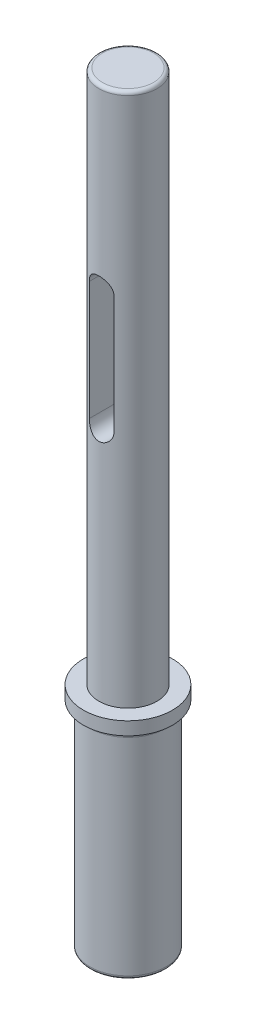
ISO-10303-21;
HEADER;
FILE_DESCRIPTION(('STEP AP214'),'2;1');
FILE_NAME('part.step','',(''),(''),'','','');
FILE_SCHEMA(('AUTOMOTIVE_DESIGN { 1 0 10303 214 1 1 1 1 }'));
ENDSEC;
DATA;
#1=APPLICATION_CONTEXT('core data for automotive mechanical design processes');
#2=APPLICATION_PROTOCOL_DEFINITION('international standard','automotive_design',2000,#1);
#3=PRODUCT_CONTEXT('',#1,'mechanical');
#4=PRODUCT('Part','Part','',(#3));
#5=PRODUCT_RELATED_PRODUCT_CATEGORY('part','',(#4));
#6=PRODUCT_DEFINITION_FORMATION('','',#4);
#7=PRODUCT_DEFINITION_CONTEXT('part definition',#1,'design');
#8=PRODUCT_DEFINITION('design','',#6,#7);
#9=PRODUCT_DEFINITION_SHAPE('','',#8);
#10=(LENGTH_UNIT() NAMED_UNIT(*) SI_UNIT(.MILLI.,.METRE.));
#11=(NAMED_UNIT(*) PLANE_ANGLE_UNIT() SI_UNIT($,.RADIAN.));
#12=(NAMED_UNIT(*) SI_UNIT($,.STERADIAN.) SOLID_ANGLE_UNIT());
#13=UNCERTAINTY_MEASURE_WITH_UNIT(LENGTH_MEASURE(1.E-05),#10,'distance_accuracy_value','');
#14=(GEOMETRIC_REPRESENTATION_CONTEXT(3) GLOBAL_UNCERTAINTY_ASSIGNED_CONTEXT((#13)) GLOBAL_UNIT_ASSIGNED_CONTEXT((#10,
#11,#12)) REPRESENTATION_CONTEXT('',''));
#15=CARTESIAN_POINT('',(0.,0.,0.));
#16=DIRECTION('',(0.,0.,1.));
#17=DIRECTION('',(1.,0.,0.));
#18=AXIS2_PLACEMENT_3D('',#15,#16,#17);
#19=CARTESIAN_POINT('',(0.,163.322,0.));
#20=DIRECTION('',(0.,-1.,0.));
#21=DIRECTION('',(0.,0.,-1.));
#22=AXIS2_PLACEMENT_3D('',#19,#20,#21);
#23=CYLINDRICAL_SURFACE('',#22,9.525);
#24=CARTESIAN_POINT('',(0.,46.228,0.));
#25=DIRECTION('',(0.,1.,0.));
#26=DIRECTION('',(0.,0.,1.));
#27=AXIS2_PLACEMENT_3D('',#24,#25,#26);
#28=CIRCLE('',#27,9.525);
#29=CARTESIAN_POINT('',(0.,46.228,9.525));
#30=VERTEX_POINT('',#29);
#31=EDGE_CURVE('E182',#30,#30,#28,.T.);
#32=ORIENTED_EDGE('',*,*,#31,.T.);
#33=EDGE_LOOP('',(#32));
#34=FACE_BOUND('',#33,.T.);
#35=CARTESIAN_POINT('',(0.,49.022,0.));
#36=DIRECTION('',(0.,1.,0.));
#37=DIRECTION('',(0.,0.,1.));
#38=AXIS2_PLACEMENT_3D('',#35,#36,#37);
#39=CIRCLE('',#38,9.525);
#40=CARTESIAN_POINT('',(0.,49.022,9.525));
#41=VERTEX_POINT('',#40);
#42=EDGE_CURVE('E184',#41,#41,#39,.T.);
#43=ORIENTED_EDGE('',*,*,#42,.F.);
#44=EDGE_LOOP('',(#43));
#45=FACE_BOUND('',#44,.T.);
#46=ADVANCED_FACE('F34',(#34,#45),#23,.T.);
#47=CARTESIAN_POINT('',(0.,46.228,0.));
#48=DIRECTION('',(0.,1.,0.));
#49=DIRECTION('',(0.,0.,1.));
#50=AXIS2_PLACEMENT_3D('',#47,#48,#49);
#51=PLANE('',#50);
#52=CARTESIAN_POINT('',(0.,46.228,0.));
#53=DIRECTION('',(0.,1.,0.));
#54=DIRECTION('',(0.,0.,1.));
#55=AXIS2_PLACEMENT_3D('',#52,#53,#54);
#56=CIRCLE('',#55,9.398);
#57=CARTESIAN_POINT('',(0.,46.228,9.398));
#58=VERTEX_POINT('',#57);
#59=EDGE_CURVE('E181',#58,#58,#56,.T.);
#60=ORIENTED_EDGE('',*,*,#59,.T.);
#61=EDGE_LOOP('',(#60));
#62=FACE_BOUND('',#61,.T.);
#63=ORIENTED_EDGE('',*,*,#31,.F.);
#64=EDGE_LOOP('',(#63));
#65=FACE_BOUND('',#64,.T.);
#66=ADVANCED_FACE('F154',(#62,#65),#51,.F.);
#67=CARTESIAN_POINT('',(0.,46.228,0.));
#68=DIRECTION('',(0.,-1.,0.));
#69=DIRECTION('',(0.,0.,-1.));
#70=AXIS2_PLACEMENT_3D('',#67,#68,#69);
#71=CYLINDRICAL_SURFACE('',#70,8.128);
#72=CARTESIAN_POINT('',(0.,0.761999999999999,0.));
#73=DIRECTION('',(0.,1.,0.));
#74=DIRECTION('',(0.,0.,1.));
#75=AXIS2_PLACEMENT_3D('',#72,#73,#74);
#76=CIRCLE('',#75,8.128);
#77=CARTESIAN_POINT('',(0.,0.761999999999999,8.128));
#78=VERTEX_POINT('',#77);
#79=EDGE_CURVE('E42',#78,#78,#76,.T.);
#80=ORIENTED_EDGE('',*,*,#79,.T.);
#81=EDGE_LOOP('',(#80));
#82=FACE_BOUND('',#81,.T.);
#83=CARTESIAN_POINT('',(0.,44.958,0.));
#84=DIRECTION('',(0.,1.,0.));
#85=DIRECTION('',(0.,0.,1.));
#86=AXIS2_PLACEMENT_3D('',#83,#84,#85);
#87=CIRCLE('',#86,8.128);
#88=CARTESIAN_POINT('',(0.,44.958,8.128));
#89=VERTEX_POINT('',#88);
#90=EDGE_CURVE('E178',#89,#89,#87,.F.);
#91=ORIENTED_EDGE('',*,*,#90,.T.);
#92=EDGE_LOOP('',(#91));
#93=FACE_BOUND('',#92,.T.);
#94=ADVANCED_FACE('F142',(#82,#93),#71,.T.);
#95=CARTESIAN_POINT('',(0.,0.,0.));
#96=DIRECTION('',(0.,1.,0.));
#97=DIRECTION('',(0.,0.,1.));
#98=AXIS2_PLACEMENT_3D('',#95,#96,#97);
#99=PLANE('',#98);
#100=CARTESIAN_POINT('',(0.,0.,0.));
#101=DIRECTION('',(0.,1.,0.));
#102=DIRECTION('',(0.,0.,1.));
#103=AXIS2_PLACEMENT_3D('',#100,#101,#102);
#104=CIRCLE('',#103,7.366);
#105=CARTESIAN_POINT('',(0.,0.,7.366));
#106=VERTEX_POINT('',#105);
#107=EDGE_CURVE('E12',#106,#106,#104,.F.);
#108=ORIENTED_EDGE('',*,*,#107,.T.);
#109=EDGE_LOOP('',(#108));
#110=FACE_BOUND('',#109,.T.);
#111=ADVANCED_FACE('F166',(#110),#99,.F.);
#112=CARTESIAN_POINT('',(0.,49.022,0.));
#113=DIRECTION('',(0.,1.,0.));
#114=DIRECTION('',(0.,0.,1.));
#115=AXIS2_PLACEMENT_3D('',#112,#113,#114);
#116=PLANE('',#115);
#117=CARTESIAN_POINT('',(0.,49.022,0.));
#118=DIRECTION('',(0.,1.,0.));
#119=DIRECTION('',(0.,0.,1.));
#120=AXIS2_PLACEMENT_3D('',#117,#118,#119);
#121=CIRCLE('',#120,6.223);
#122=CARTESIAN_POINT('',(0.,49.022,6.223));
#123=VERTEX_POINT('',#122);
#124=EDGE_CURVE('E188',#123,#123,#121,.T.);
#125=ORIENTED_EDGE('',*,*,#124,.F.);
#126=EDGE_LOOP('',(#125));
#127=FACE_BOUND('',#126,.T.);
#128=ORIENTED_EDGE('',*,*,#42,.T.);
#129=EDGE_LOOP('',(#128));
#130=FACE_BOUND('',#129,.T.);
#131=ADVANCED_FACE('F202',(#127,#130),#116,.T.);
#132=CARTESIAN_POINT('',(0.,49.022,0.));
#133=DIRECTION('',(0.,1.,0.));
#134=DIRECTION('',(0.,0.,1.));
#135=AXIS2_PLACEMENT_3D('',#132,#133,#134);
#136=CYLINDRICAL_SURFACE('',#135,6.223);
#137=CARTESIAN_POINT('',(0.,162.56,0.));
#138=DIRECTION('',(0.,1.,0.));
#139=DIRECTION('',(0.,0.,1.));
#140=AXIS2_PLACEMENT_3D('',#137,#138,#139);
#141=CIRCLE('',#140,6.223);
#142=CARTESIAN_POINT('',(0.,162.56,6.223));
#143=VERTEX_POINT('',#142);
#144=EDGE_CURVE('E137',#143,#143,#141,.F.);
#145=ORIENTED_EDGE('',*,*,#144,.T.);
#146=EDGE_LOOP('',(#145));
#147=FACE_BOUND('',#146,.T.);
#148=CARTESIAN_POINT('',(2.63525,125.222,5.63748050440088));
#149=CARTESIAN_POINT('',(2.63526092561611,125.292496133646,5.63746473485231));
#150=CARTESIAN_POINT('',(2.63242152995467,125.362983653104,5.6388024376329));
#151=CARTESIAN_POINT('',(2.62112760740143,125.503380792893,5.64406676640251));
#152=CARTESIAN_POINT('',(2.61267548099446,125.573290647347,5.64799228561415));
#153=CARTESIAN_POINT('',(2.59028987479993,125.711733625298,5.65829214310936));
#154=CARTESIAN_POINT('',(2.57638020386171,125.780271387643,5.66465584189996));
#155=CARTESIAN_POINT('',(2.54324139835164,125.91578488149,5.6796110209825));
#156=CARTESIAN_POINT('',(2.52401188265636,125.982760500703,5.68820266088546));
#157=CARTESIAN_POINT('',(2.45866508493166,126.180500345465,5.71690282412895));
#158=CARTESIAN_POINT('',(2.40483947686921,126.308382134382,5.73996112837516));
#159=CARTESIAN_POINT('',(2.27839308367063,126.553365402542,5.79131151311052));
#160=CARTESIAN_POINT('',(2.20575197818582,126.670455039962,5.81960924258947));
#161=CARTESIAN_POINT('',(2.0388034996296,126.897961707338,5.88024922041058));
#162=CARTESIAN_POINT('',(1.94348718040564,127.0076029206,5.91273066395817));
#163=CARTESIAN_POINT('',(1.73602801448835,127.209901841164,5.97693223995484));
#164=CARTESIAN_POINT('',(1.62388150837406,127.302555845146,6.00865220508997));
#165=CARTESIAN_POINT('',(1.37971670120795,127.472334325471,6.06948268214758));
#166=CARTESIAN_POINT('',(1.24702975351921,127.548568647991,6.09841068827836));
#167=CARTESIAN_POINT('',(0.969268258250059,127.677292223929,6.14866811335755));
#168=CARTESIAN_POINT('',(0.824199468826965,127.729792444098,6.17000104077322));
#169=CARTESIAN_POINT('',(0.534030859896944,127.806697014112,6.20166784005851));
#170=CARTESIAN_POINT('',(0.389348674568612,127.83245530892,6.21252952182366));
#171=CARTESIAN_POINT('',(0.0973329188376938,127.859526331072,6.22395137323909));
#172=CARTESIAN_POINT('',(-0.0499995623099279,127.860848881521,6.22451568240497));
#173=CARTESIAN_POINT('',(-0.333262970167122,127.839705353295,6.21558502916184));
#174=CARTESIAN_POINT('',(-0.469328685508396,127.818728560471,6.20671980695967));
#175=CARTESIAN_POINT('',(-0.735793986200554,127.756143645781,6.18079791647864));
#176=CARTESIAN_POINT('',(-0.866193253445365,127.714534367261,6.16374078896441));
#177=CARTESIAN_POINT('',(-1.12003071721949,127.611380132997,6.12274913466574));
#178=CARTESIAN_POINT('',(-1.24333193692992,127.549539991569,6.09871340717739));
#179=CARTESIAN_POINT('',(-1.4781325058302,127.407973224129,6.04610224834687));
#180=CARTESIAN_POINT('',(-1.58962747980308,127.328240001116,6.01752514378148));
#181=CARTESIAN_POINT('',(-1.80623014342521,127.146444647836,5.95624323888449));
#182=CARTESIAN_POINT('',(-1.91029094051194,127.043183835958,5.92338938771368));
#183=CARTESIAN_POINT('',(-2.10009356550888,126.82060948677,5.85878919427034));
#184=CARTESIAN_POINT('',(-2.18582567216152,126.701287485251,5.82704344715078));
#185=CARTESIAN_POINT('',(-2.33937603841655,126.444701924157,5.76715660615296));
#186=CARTESIAN_POINT('',(-2.40645220062378,126.30695256072,5.73918302423354));
#187=CARTESIAN_POINT('',(-2.51595094821626,126.020692260827,5.69204014068779));
#188=CARTESIAN_POINT('',(-2.55841976258902,125.872202097233,5.67285434405372));
#189=CARTESIAN_POINT('',(-2.60341921135921,125.638825880487,5.65227600194901));
#190=CARTESIAN_POINT('',(-2.61533382912357,125.556009314821,5.64675848894065));
#191=CARTESIAN_POINT('',(-2.63125342507827,125.389480895437,5.63934970680858));
#192=CARTESIAN_POINT('',(-2.63526028800966,125.305769259836,5.63745757361188));
#193=CARTESIAN_POINT('',(-2.63525,125.222,5.63748050440088));
#194=B_SPLINE_CURVE_WITH_KNOTS('',3,(#148,#149,#150,#151,#152,#153,#154,#155,#156,#157,#158,
#159,#160,#161,#162,#163,#164,#165,#166,#167,#168,#169,#170,#171,#172,#173,#174,#175,#176,#177,
#178,#179,#180,#181,#182,#183,#184,#185,#186,#187,#188,#189,#190,#191,#192,#193),.UNSPECIFIED.,
.F.,.F.,(4,2,2,2,2,2,2,2,2,2,2,2,2,2,2,2,2,2,2,2,2,2,4),(0.,0.211404261674563,0.422718166944853,
0.633120274115882,0.843537458784705,1.26345458958315,1.68382712693088,2.12847560286991,
2.57322090006217,3.03804865058591,3.50266139933328,3.94239494434604,4.3819517137815,
4.79389360256984,5.20585858737335,5.62412465282926,6.04254518289059,6.49125979169262,
6.94021180466895,7.40506628666454,7.86904460689332,8.12018637590568,8.37126828034182),.UNSPECIFIED.);
#195=CARTESIAN_POINT('',(2.63525,125.222,5.63748050440087));
#196=VERTEX_POINT('',#195);
#197=CARTESIAN_POINT('',(-2.63524999999999,125.222,5.63748050440088));
#198=VERTEX_POINT('',#197);
#199=EDGE_CURVE('E94',#196,#198,#194,.T.);
#200=ORIENTED_EDGE('',*,*,#199,.F.);
#201=DIRECTION('',(0.,1.,0.));
#202=VECTOR('',#201,1.);
#203=CARTESIAN_POINT('',(2.63525000000001,49.022,5.63748050440087));
#204=LINE('',#203,#202);
#205=CARTESIAN_POINT('',(2.63525000000001,99.822,5.63748050440088));
#206=VERTEX_POINT('',#205);
#207=EDGE_CURVE('E92',#206,#196,#204,.T.);
#208=ORIENTED_EDGE('',*,*,#207,.F.);
#209=CARTESIAN_POINT('',(-2.63524999999999,99.822,5.63748050440088));
#210=CARTESIAN_POINT('',(-2.6352609256161,99.7515038663542,5.63746473485231));
#211=CARTESIAN_POINT('',(-2.63242152995466,99.6810163468958,5.6388024376329));
#212=CARTESIAN_POINT('',(-2.62112760740143,99.540619207107,5.64406676640251));
#213=CARTESIAN_POINT('',(-2.61267548099446,99.4707093526531,5.64799228561415));
#214=CARTESIAN_POINT('',(-2.59028987479993,99.3322663747022,5.65829214310937));
#215=CARTESIAN_POINT('',(-2.57638020386171,99.2637286123567,5.66465584189996));
#216=CARTESIAN_POINT('',(-2.54324139835163,99.1282151185102,5.6796110209825));
#217=CARTESIAN_POINT('',(-2.52401188265635,99.0612394992968,5.68820266088546));
#218=CARTESIAN_POINT('',(-2.45866508493166,98.8634996545355,5.71690282412895));
#219=CARTESIAN_POINT('',(-2.4048394768692,98.7356178656184,5.73996112837516));
#220=CARTESIAN_POINT('',(-2.27839308367063,98.4906345974585,5.79131151311052));
#221=CARTESIAN_POINT('',(-2.20575197818584,98.3735449600375,5.81960924258947));
#222=CARTESIAN_POINT('',(-2.03880349962962,98.1460382926615,5.88024922041057));
#223=CARTESIAN_POINT('',(-1.94348718040566,98.0363970794001,5.91273066395817));
#224=CARTESIAN_POINT('',(-1.73602801448837,97.8340981588363,5.97693223995483));
#225=CARTESIAN_POINT('',(-1.62388150837408,97.7414441548544,6.00865220508997));
#226=CARTESIAN_POINT('',(-1.37971670120797,97.5716656745292,6.06948268214758));
#227=CARTESIAN_POINT('',(-1.24702975351923,97.495431352009,6.09841068827835));
#228=CARTESIAN_POINT('',(-0.969268258250077,97.3667077760714,6.14866811335755));
#229=CARTESIAN_POINT('',(-0.824199468826984,97.3142075559017,6.17000104077322));
#230=CARTESIAN_POINT('',(-0.534030859896963,97.2373029858882,6.20166784005851));
#231=CARTESIAN_POINT('',(-0.38934867456863,97.2115446910801,6.21252952182365));
#232=CARTESIAN_POINT('',(-0.0973329188377099,97.1844736689279,6.22395137323909));
#233=CARTESIAN_POINT('',(0.0499995623099126,97.1831511184787,6.22451568240497));
#234=CARTESIAN_POINT('',(0.333262970167108,97.2042946467048,6.21558502916184));
#235=CARTESIAN_POINT('',(0.469328685508384,97.2252714395289,6.20671980695968));
#236=CARTESIAN_POINT('',(0.735793986200543,97.2878563542191,6.18079791647864));
#237=CARTESIAN_POINT('',(0.866193253445355,97.3294656327394,6.16374078896441));
#238=CARTESIAN_POINT('',(1.12003071721948,97.4326198670029,6.12274913466574));
#239=CARTESIAN_POINT('',(1.2433319369299,97.4944600084309,6.0987134071774));
#240=CARTESIAN_POINT('',(1.47813250583018,97.6360267758712,6.04610224834687));
#241=CARTESIAN_POINT('',(1.58962747980307,97.7157599988835,6.01752514378148));
#242=CARTESIAN_POINT('',(1.80623014342521,97.8975553521643,5.95624323888449));
#243=CARTESIAN_POINT('',(1.91029094051193,98.000816164042,5.92338938771369));
#244=CARTESIAN_POINT('',(2.10009356550887,98.2233905132303,5.85878919427034));
#245=CARTESIAN_POINT('',(2.18582567216151,98.3427125147492,5.82704344715078));
#246=CARTESIAN_POINT('',(2.33937603841655,98.5992980758434,5.76715660615297));
#247=CARTESIAN_POINT('',(2.40645220062378,98.7370474392804,5.73918302423354));
#248=CARTESIAN_POINT('',(2.51595094821626,99.0233077391727,5.69204014068779));
#249=CARTESIAN_POINT('',(2.55841976258902,99.1717979027665,5.67285434405371));
#250=CARTESIAN_POINT('',(2.60341921135922,99.4051741195131,5.652276001949));
#251=CARTESIAN_POINT('',(2.61533382912357,99.4879906851794,5.64675848894065));
#252=CARTESIAN_POINT('',(2.63125342507827,99.6545191045626,5.63934970680858));
#253=CARTESIAN_POINT('',(2.63526028800966,99.7382307401643,5.63745757361188));
#254=CARTESIAN_POINT('',(2.63525000000001,99.822,5.63748050440088));
#255=B_SPLINE_CURVE_WITH_KNOTS('',3,(#209,#210,#211,#212,#213,#214,#215,#216,#217,#218,#219,
#220,#221,#222,#223,#224,#225,#226,#227,#228,#229,#230,#231,#232,#233,#234,#235,#236,#237,#238,
#239,#240,#241,#242,#243,#244,#245,#246,#247,#248,#249,#250,#251,#252,#253,#254),.UNSPECIFIED.,
.F.,.F.,(4,2,2,2,2,2,2,2,2,2,2,2,2,2,2,2,2,2,2,2,2,2,4),(0.,0.211404261674577,0.422718166944839,
0.633120274115911,0.84353745878469,1.26345458958312,1.68382712693084,2.12847560286988,
2.57322090006214,3.03804865058589,3.50266139933326,3.94239494434602,4.38195171378148,
4.79389360256982,5.20585858737334,5.62412465282924,6.04254518289057,6.49125979169261,
6.9402118046689,7.4050662866645,7.86904460689329,8.12018637590563,8.37126828034181),.UNSPECIFIED.);
#256=CARTESIAN_POINT('',(-2.63524999999999,99.822,5.63748050440089));
#257=VERTEX_POINT('',#256);
#258=EDGE_CURVE('E77',#257,#206,#255,.T.);
#259=ORIENTED_EDGE('',*,*,#258,.F.);
#260=DIRECTION('',(0.,1.,0.));
#261=VECTOR('',#260,1.);
#262=CARTESIAN_POINT('',(-2.63524999999999,49.022,5.63748050440088));
#263=LINE('',#262,#261);
#264=EDGE_CURVE('E72',#198,#257,#263,.F.);
#265=ORIENTED_EDGE('',*,*,#264,.F.);
#266=EDGE_LOOP('',(#200,#208,#259,#265));
#267=FACE_BOUND('',#266,.T.);
#268=CARTESIAN_POINT('',(-2.63525,125.222,-5.63748050440088));
#269=CARTESIAN_POINT('',(-2.63526092561611,125.292496133646,-5.63746473485231));
#270=CARTESIAN_POINT('',(-2.63242152995467,125.362983653104,-5.6388024376329));
#271=CARTESIAN_POINT('',(-2.62112760740143,125.503380792893,-5.64406676640251));
#272=CARTESIAN_POINT('',(-2.61267548099446,125.573290647347,-5.64799228561415));
#273=CARTESIAN_POINT('',(-2.59028987479993,125.711733625298,-5.65829214310936));
#274=CARTESIAN_POINT('',(-2.57638020386171,125.780271387643,-5.66465584189996));
#275=CARTESIAN_POINT('',(-2.54324139835164,125.91578488149,-5.6796110209825));
#276=CARTESIAN_POINT('',(-2.52401188265635,125.982760500703,-5.68820266088546));
#277=CARTESIAN_POINT('',(-2.45866508493166,126.180500345465,-5.71690282412895));
#278=CARTESIAN_POINT('',(-2.4048394768692,126.308382134382,-5.73996112837516));
#279=CARTESIAN_POINT('',(-2.27839308367063,126.553365402542,-5.79131151311052));
#280=CARTESIAN_POINT('',(-2.20575197818582,126.670455039962,-5.81960924258948));
#281=CARTESIAN_POINT('',(-2.0388034996296,126.897961707338,-5.88024922041058));
#282=CARTESIAN_POINT('',(-1.94348718040563,127.0076029206,-5.91273066395817));
#283=CARTESIAN_POINT('',(-1.73602801448835,127.209901841164,-5.97693223995484));
#284=CARTESIAN_POINT('',(-1.62388150837405,127.302555845146,-6.00865220508997));
#285=CARTESIAN_POINT('',(-1.37971670120794,127.472334325471,-6.06948268214759));
#286=CARTESIAN_POINT('',(-1.2470297535192,127.548568647991,-6.09841068827836));
#287=CARTESIAN_POINT('',(-0.969268258250056,127.677292223929,-6.14866811335755));
#288=CARTESIAN_POINT('',(-0.824199468826962,127.729792444098,-6.17000104077322));
#289=CARTESIAN_POINT('',(-0.534030859896941,127.806697014112,-6.20166784005851));
#290=CARTESIAN_POINT('',(-0.389348674568609,127.83245530892,-6.21252952182366));
#291=CARTESIAN_POINT('',(-0.0973329188376909,127.859526331072,-6.22395137323909));
#292=CARTESIAN_POINT('',(0.0499995623099309,127.860848881521,-6.22451568240497));
#293=CARTESIAN_POINT('',(0.333262970167125,127.839705353295,-6.21558502916184));
#294=CARTESIAN_POINT('',(0.469328685508399,127.818728560471,-6.20671980695968));
#295=CARTESIAN_POINT('',(0.735793986200557,127.756143645781,-6.18079791647864));
#296=CARTESIAN_POINT('',(0.866193253445368,127.714534367261,-6.16374078896441));
#297=CARTESIAN_POINT('',(1.12003071721949,127.611380132997,-6.12274913466573));
#298=CARTESIAN_POINT('',(1.24333193692992,127.549539991569,-6.09871340717739));
#299=CARTESIAN_POINT('',(1.4781325058302,127.407973224129,-6.04610224834687));
#300=CARTESIAN_POINT('',(1.58962747980308,127.328240001116,-6.01752514378148));
#301=CARTESIAN_POINT('',(1.80623014342522,127.146444647836,-5.95624323888449));
#302=CARTESIAN_POINT('',(1.91029094051194,127.043183835958,-5.92338938771368));
#303=CARTESIAN_POINT('',(2.10009356550889,126.82060948677,-5.85878919427033));
#304=CARTESIAN_POINT('',(2.18582567216153,126.701287485251,-5.82704344715078));
#305=CARTESIAN_POINT('',(2.33937603841656,126.444701924157,-5.76715660615296));
#306=CARTESIAN_POINT('',(2.40645220062378,126.30695256072,-5.73918302423354));
#307=CARTESIAN_POINT('',(2.51595094821627,126.020692260827,-5.69204014068778));
#308=CARTESIAN_POINT('',(2.55841976258902,125.872202097233,-5.67285434405371));
#309=CARTESIAN_POINT('',(2.60341921135922,125.638825880487,-5.652276001949));
#310=CARTESIAN_POINT('',(2.61533382912357,125.556009314821,-5.64675848894065));
#311=CARTESIAN_POINT('',(2.63125342507827,125.389480895437,-5.63934970680858));
#312=CARTESIAN_POINT('',(2.63526028800966,125.305769259836,-5.63745757361188));
#313=CARTESIAN_POINT('',(2.63525,125.222,-5.63748050440088));
#314=B_SPLINE_CURVE_WITH_KNOTS('',3,(#268,#269,#270,#271,#272,#273,#274,#275,#276,#277,#278,
#279,#280,#281,#282,#283,#284,#285,#286,#287,#288,#289,#290,#291,#292,#293,#294,#295,#296,#297,
#298,#299,#300,#301,#302,#303,#304,#305,#306,#307,#308,#309,#310,#311,#312,#313),.UNSPECIFIED.,
.F.,.F.,(4,2,2,2,2,2,2,2,2,2,2,2,2,2,2,2,2,2,2,2,2,2,4),(0.,0.211404261674563,0.422718166944853,
0.633120274115882,0.843537458784705,1.26345458958315,1.68382712693088,2.12847560286991,
2.57322090006217,3.03804865058591,3.50266139933328,3.94239494434604,4.3819517137815,
4.79389360256984,5.20585858737335,5.62412465282926,6.04254518289059,6.49125979169262,
6.94021180466895,7.40506628666454,7.86904460689332,8.12018637590568,8.37126828034181),.UNSPECIFIED.);
#315=CARTESIAN_POINT('',(-2.63525,125.222,-5.63748050440088));
#316=VERTEX_POINT('',#315);
#317=CARTESIAN_POINT('',(2.63525,125.222,-5.63748050440087));
#318=VERTEX_POINT('',#317);
#319=EDGE_CURVE('E78',#316,#318,#314,.T.);
#320=ORIENTED_EDGE('',*,*,#319,.F.);
#321=DIRECTION('',(0.,1.,0.));
#322=VECTOR('',#321,1.);
#323=CARTESIAN_POINT('',(-2.63524999999999,49.022,-5.63748050440088));
#324=LINE('',#323,#322);
#325=CARTESIAN_POINT('',(-2.63524999999999,99.822,-5.63748050440088));
#326=VERTEX_POINT('',#325);
#327=EDGE_CURVE('E119',#326,#316,#324,.T.);
#328=ORIENTED_EDGE('',*,*,#327,.F.);
#329=CARTESIAN_POINT('',(2.63525000000001,99.822,-5.63748050440088));
#330=CARTESIAN_POINT('',(2.63526092561611,99.7515038663542,-5.6374647348523));
#331=CARTESIAN_POINT('',(2.63242152995467,99.6810163468958,-5.63880243763289));
#332=CARTESIAN_POINT('',(2.62112760740144,99.540619207107,-5.6440667664025));
#333=CARTESIAN_POINT('',(2.61267548099447,99.4707093526531,-5.64799228561415));
#334=CARTESIAN_POINT('',(2.59028987479994,99.3322663747022,-5.65829214310936));
#335=CARTESIAN_POINT('',(2.57638020386172,99.2637286123567,-5.66465584189996));
#336=CARTESIAN_POINT('',(2.54324139835164,99.1282151185102,-5.6796110209825));
#337=CARTESIAN_POINT('',(2.52401188265636,99.0612394992968,-5.68820266088546));
#338=CARTESIAN_POINT('',(2.45866508493167,98.8634996545355,-5.71690282412895));
#339=CARTESIAN_POINT('',(2.40483947686921,98.7356178656183,-5.73996112837515));
#340=CARTESIAN_POINT('',(2.27839308367064,98.4906345974584,-5.79131151311051));
#341=CARTESIAN_POINT('',(2.20575197818585,98.3735449600375,-5.81960924258947));
#342=CARTESIAN_POINT('',(2.03880349962964,98.1460382926615,-5.88024922041057));
#343=CARTESIAN_POINT('',(1.94348718040567,98.0363970794001,-5.91273066395816));
#344=CARTESIAN_POINT('',(1.73602801448838,97.8340981588363,-5.97693223995483));
#345=CARTESIAN_POINT('',(1.62388150837409,97.7414441548544,-6.00865220508997));
#346=CARTESIAN_POINT('',(1.37971670120798,97.5716656745292,-6.06948268214758));
#347=CARTESIAN_POINT('',(1.24702975351924,97.495431352009,-6.09841068827835));
#348=CARTESIAN_POINT('',(0.969268258250087,97.3667077760714,-6.14866811335755));
#349=CARTESIAN_POINT('',(0.824199468826995,97.3142075559017,-6.17000104077322));
#350=CARTESIAN_POINT('',(0.534030859896973,97.2373029858882,-6.2016678400585));
#351=CARTESIAN_POINT('',(0.38934867456864,97.2115446910801,-6.21252952182365));
#352=CARTESIAN_POINT('',(0.0973329188377201,97.1844736689279,-6.22395137323909));
#353=CARTESIAN_POINT('',(-0.0499995623099024,97.1831511184787,-6.22451568240497));
#354=CARTESIAN_POINT('',(-0.333262970167098,97.2042946467048,-6.21558502916184));
#355=CARTESIAN_POINT('',(-0.469328685508374,97.2252714395289,-6.20671980695968));
#356=CARTESIAN_POINT('',(-0.735793986200534,97.2878563542191,-6.18079791647865));
#357=CARTESIAN_POINT('',(-0.866193253445345,97.3294656327394,-6.16374078896441));
#358=CARTESIAN_POINT('',(-1.12003071721947,97.4326198670029,-6.12274913466574));
#359=CARTESIAN_POINT('',(-1.24333193692989,97.4944600084309,-6.0987134071774));
#360=CARTESIAN_POINT('',(-1.47813250583017,97.6360267758712,-6.04610224834687));
#361=CARTESIAN_POINT('',(-1.58962747980306,97.7157599988835,-6.01752514378148));
#362=CARTESIAN_POINT('',(-1.8062301434252,97.8975553521643,-5.95624323888449));
#363=CARTESIAN_POINT('',(-1.91029094051192,98.0008161640421,-5.92338938771369));
#364=CARTESIAN_POINT('',(-2.10009356550887,98.2233905132303,-5.85878919427034));
#365=CARTESIAN_POINT('',(-2.1858256721615,98.3427125147492,-5.82704344715079));
#366=CARTESIAN_POINT('',(-2.33937603841654,98.5992980758434,-5.76715660615297));
#367=CARTESIAN_POINT('',(-2.40645220062376,98.7370474392804,-5.73918302423354));
#368=CARTESIAN_POINT('',(-2.51595094821625,99.0233077391727,-5.69204014068779));
#369=CARTESIAN_POINT('',(-2.55841976258901,99.1717979027665,-5.67285434405372));
#370=CARTESIAN_POINT('',(-2.60341921135921,99.4051741195132,-5.65227600194901));
#371=CARTESIAN_POINT('',(-2.61533382912356,99.4879906851794,-5.64675848894065));
#372=CARTESIAN_POINT('',(-2.63125342507826,99.6545191045626,-5.63934970680859));
#373=CARTESIAN_POINT('',(-2.63526028800965,99.7382307401643,-5.63745757361189));
#374=CARTESIAN_POINT('',(-2.63524999999999,99.822,-5.63748050440088));
#375=B_SPLINE_CURVE_WITH_KNOTS('',3,(#329,#330,#331,#332,#333,#334,#335,#336,#337,#338,#339,
#340,#341,#342,#343,#344,#345,#346,#347,#348,#349,#350,#351,#352,#353,#354,#355,#356,#357,#358,
#359,#360,#361,#362,#363,#364,#365,#366,#367,#368,#369,#370,#371,#372,#373,#374),.UNSPECIFIED.,
.F.,.F.,(4,2,2,2,2,2,2,2,2,2,2,2,2,2,2,2,2,2,2,2,2,2,4),(0.,0.211404261674577,0.422718166944839,
0.633120274115911,0.84353745878469,1.26345458958314,1.68382712693084,2.12847560286988,
2.57322090006214,3.03804865058589,3.50266139933326,3.94239494434602,4.38195171378148,
4.79389360256982,5.20585858737334,5.62412465282924,6.04254518289057,6.49125979169262,
6.9402118046689,7.4050662866645,7.86904460689329,8.12018637590564,8.37126828034181),.UNSPECIFIED.);
#376=CARTESIAN_POINT('',(2.63525000000001,99.822,-5.63748050440088));
#377=VERTEX_POINT('',#376);
#378=EDGE_CURVE('E85',#377,#326,#375,.T.);
#379=ORIENTED_EDGE('',*,*,#378,.F.);
#380=DIRECTION('',(0.,1.,0.));
#381=VECTOR('',#380,1.);
#382=CARTESIAN_POINT('',(2.63525000000001,49.022,-5.63748050440087));
#383=LINE('',#382,#381);
#384=EDGE_CURVE('E118',#318,#377,#383,.F.);
#385=ORIENTED_EDGE('',*,*,#384,.F.);
#386=EDGE_LOOP('',(#320,#328,#379,#385));
#387=FACE_BOUND('',#386,.T.);
#388=ORIENTED_EDGE('',*,*,#124,.T.);
#389=EDGE_LOOP('',(#388));
#390=FACE_BOUND('',#389,.T.);
#391=ADVANCED_FACE('F90',(#147,#267,#387,#390),#136,.T.);
#392=CARTESIAN_POINT('',(0.,163.322,0.));
#393=DIRECTION('',(0.,1.,0.));
#394=DIRECTION('',(0.,0.,1.));
#395=AXIS2_PLACEMENT_3D('',#392,#393,#394);
#396=PLANE('',#395);
#397=CARTESIAN_POINT('',(0.,163.322,0.));
#398=DIRECTION('',(0.,1.,0.));
#399=DIRECTION('',(0.,0.,1.));
#400=AXIS2_PLACEMENT_3D('',#397,#398,#399);
#401=CIRCLE('',#400,5.461);
#402=CARTESIAN_POINT('',(0.,163.322,5.461));
#403=VERTEX_POINT('',#402);
#404=EDGE_CURVE('E134',#403,#403,#401,.T.);
#405=ORIENTED_EDGE('',*,*,#404,.T.);
#406=EDGE_LOOP('',(#405));
#407=FACE_BOUND('',#406,.T.);
#408=ADVANCED_FACE('F169',(#407),#396,.T.);
#409=CARTESIAN_POINT('',(0.,44.958,0.));
#410=DIRECTION('',(0.,1.,0.));
#411=DIRECTION('',(0.,0.,1.));
#412=AXIS2_PLACEMENT_3D('',#409,#410,#411);
#413=TOROIDAL_SURFACE('',#412,9.398,1.27);
#414=ORIENTED_EDGE('',*,*,#90,.F.);
#415=EDGE_LOOP('',(#414));
#416=FACE_BOUND('',#415,.T.);
#417=ORIENTED_EDGE('',*,*,#59,.F.);
#418=EDGE_LOOP('',(#417));
#419=FACE_BOUND('',#418,.T.);
#420=ADVANCED_FACE('F127',(#416,#419),#413,.F.);
#421=CARTESIAN_POINT('',(0.,125.222,-9.525));
#422=DIRECTION('',(0.,0.,1.));
#423=DIRECTION('',(1.,0.,0.));
#424=AXIS2_PLACEMENT_3D('',#421,#422,#423);
#425=CYLINDRICAL_SURFACE('',#424,2.63525);
#426=ORIENTED_EDGE('',*,*,#319,.T.);
#427=DIRECTION('',(0.,0.,1.));
#428=VECTOR('',#427,1.);
#429=CARTESIAN_POINT('',(2.63525,125.222,-9.525));
#430=LINE('',#429,#428);
#431=EDGE_CURVE('E192',#318,#196,#430,.T.);
#432=ORIENTED_EDGE('',*,*,#431,.T.);
#433=ORIENTED_EDGE('',*,*,#199,.T.);
#434=DIRECTION('',(0.,0.,1.));
#435=VECTOR('',#434,1.);
#436=CARTESIAN_POINT('',(-2.63525,125.222,-9.525));
#437=LINE('',#436,#435);
#438=EDGE_CURVE('E49',#316,#198,#437,.T.);
#439=ORIENTED_EDGE('',*,*,#438,.F.);
#440=EDGE_LOOP('',(#426,#432,#433,#439));
#441=FACE_BOUND('',#440,.T.);
#442=ADVANCED_FACE('F124',(#441),#425,.F.);
#443=CARTESIAN_POINT('',(2.63525,125.222,-9.525));
#444=DIRECTION('',(1.,0.,0.));
#445=DIRECTION('',(0.,1.,0.));
#446=AXIS2_PLACEMENT_3D('',#443,#444,#445);
#447=PLANE('',#446);
#448=ORIENTED_EDGE('',*,*,#384,.T.);
#449=DIRECTION('',(0.,0.,1.));
#450=VECTOR('',#449,1.);
#451=CARTESIAN_POINT('',(2.63525000000001,99.822,-9.525));
#452=LINE('',#451,#450);
#453=EDGE_CURVE('E87',#377,#206,#452,.T.);
#454=ORIENTED_EDGE('',*,*,#453,.T.);
#455=ORIENTED_EDGE('',*,*,#207,.T.);
#456=ORIENTED_EDGE('',*,*,#431,.F.);
#457=EDGE_LOOP('',(#448,#454,#455,#456));
#458=FACE_BOUND('',#457,.T.);
#459=ADVANCED_FACE('F110',(#458),#447,.F.);
#460=CARTESIAN_POINT('',(0.,99.822,-9.525));
#461=DIRECTION('',(0.,0.,1.));
#462=DIRECTION('',(1.,0.,0.));
#463=AXIS2_PLACEMENT_3D('',#460,#461,#462);
#464=CYLINDRICAL_SURFACE('',#463,2.63525);
#465=ORIENTED_EDGE('',*,*,#378,.T.);
#466=DIRECTION('',(0.,0.,1.));
#467=VECTOR('',#466,1.);
#468=CARTESIAN_POINT('',(-2.63524999999999,99.822,-9.525));
#469=LINE('',#468,#467);
#470=EDGE_CURVE('E54',#326,#257,#469,.T.);
#471=ORIENTED_EDGE('',*,*,#470,.T.);
#472=ORIENTED_EDGE('',*,*,#258,.T.);
#473=ORIENTED_EDGE('',*,*,#453,.F.);
#474=EDGE_LOOP('',(#465,#471,#472,#473));
#475=FACE_BOUND('',#474,.T.);
#476=ADVANCED_FACE('F81',(#475),#464,.F.);
#477=CARTESIAN_POINT('',(-2.63525,125.222,-9.525));
#478=DIRECTION('',(-1.,0.,0.));
#479=DIRECTION('',(0.,-1.,0.));
#480=AXIS2_PLACEMENT_3D('',#477,#478,#479);
#481=PLANE('',#480);
#482=ORIENTED_EDGE('',*,*,#264,.T.);
#483=ORIENTED_EDGE('',*,*,#470,.F.);
#484=ORIENTED_EDGE('',*,*,#327,.T.);
#485=ORIENTED_EDGE('',*,*,#438,.T.);
#486=EDGE_LOOP('',(#482,#483,#484,#485));
#487=FACE_BOUND('',#486,.T.);
#488=ADVANCED_FACE('F73',(#487),#481,.F.);
#489=CARTESIAN_POINT('',(0.,162.56,0.));
#490=DIRECTION('',(0.,1.,0.));
#491=DIRECTION('',(0.,0.,1.));
#492=AXIS2_PLACEMENT_3D('',#489,#490,#491);
#493=TOROIDAL_SURFACE('',#492,5.461,0.762);
#494=ORIENTED_EDGE('',*,*,#144,.F.);
#495=EDGE_LOOP('',(#494));
#496=FACE_BOUND('',#495,.T.);
#497=ORIENTED_EDGE('',*,*,#404,.F.);
#498=EDGE_LOOP('',(#497));
#499=FACE_BOUND('',#498,.T.);
#500=ADVANCED_FACE('F146',(#496,#499),#493,.T.);
#501=CARTESIAN_POINT('',(0.,0.761999999999999,0.));
#502=DIRECTION('',(0.,1.,0.));
#503=DIRECTION('',(0.,0.,1.));
#504=AXIS2_PLACEMENT_3D('',#501,#502,#503);
#505=TOROIDAL_SURFACE('',#504,7.366,0.762);
#506=ORIENTED_EDGE('',*,*,#107,.F.);
#507=EDGE_LOOP('',(#506));
#508=FACE_BOUND('',#507,.T.);
#509=ORIENTED_EDGE('',*,*,#79,.F.);
#510=EDGE_LOOP('',(#509));
#511=FACE_BOUND('',#510,.T.);
#512=ADVANCED_FACE('F36',(#508,#511),#505,.T.);
#513=CLOSED_SHELL('',(#46,#66,#94,#111,#131,#391,#408,#420,#442,#459,#476,#488,#500,#512));
#514=MANIFOLD_SOLID_BREP('B2',#513);
#515=ADVANCED_BREP_SHAPE_REPRESENTATION('',(#18,#514),#14);
#516=SHAPE_DEFINITION_REPRESENTATION(#9,#515);
ENDSEC;
END-ISO-10303-21;
